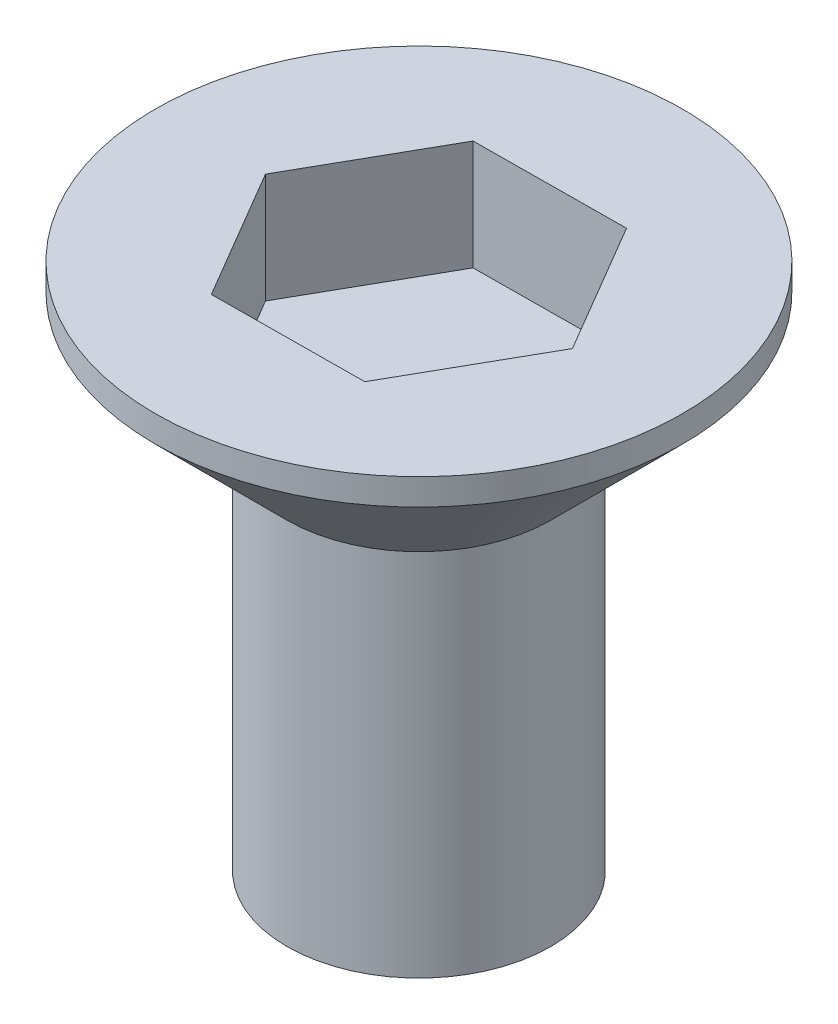
ISO-10303-21;
HEADER;
FILE_DESCRIPTION(('STEP AP214'),'2;1');
FILE_NAME('part.step','',(''),(''),'','','');
FILE_SCHEMA(('AUTOMOTIVE_DESIGN { 1 0 10303 214 1 1 1 1 }'));
ENDSEC;
DATA;
#1=APPLICATION_CONTEXT('core data for automotive mechanical design processes');
#2=APPLICATION_PROTOCOL_DEFINITION('international standard','automotive_design',2000,#1);
#3=PRODUCT_CONTEXT('',#1,'mechanical');
#4=PRODUCT('Part','Part','',(#3));
#5=PRODUCT_RELATED_PRODUCT_CATEGORY('part','',(#4));
#6=PRODUCT_DEFINITION_FORMATION('','',#4);
#7=PRODUCT_DEFINITION_CONTEXT('part definition',#1,'design');
#8=PRODUCT_DEFINITION('design','',#6,#7);
#9=PRODUCT_DEFINITION_SHAPE('','',#8);
#10=(LENGTH_UNIT() NAMED_UNIT(*) SI_UNIT(.MILLI.,.METRE.));
#11=(NAMED_UNIT(*) PLANE_ANGLE_UNIT() SI_UNIT($,.RADIAN.));
#12=(NAMED_UNIT(*) SI_UNIT($,.STERADIAN.) SOLID_ANGLE_UNIT());
#13=UNCERTAINTY_MEASURE_WITH_UNIT(LENGTH_MEASURE(1.E-05),#10,'distance_accuracy_value','');
#14=(GEOMETRIC_REPRESENTATION_CONTEXT(3) GLOBAL_UNCERTAINTY_ASSIGNED_CONTEXT((#13)) GLOBAL_UNIT_ASSIGNED_CONTEXT((#10,
#11,#12)) REPRESENTATION_CONTEXT('',''));
#15=CARTESIAN_POINT('',(0.,0.,0.));
#16=DIRECTION('',(0.,0.,1.));
#17=DIRECTION('',(1.,0.,0.));
#18=AXIS2_PLACEMENT_3D('',#15,#16,#17);
#19=CARTESIAN_POINT('',(0.,0.,0.));
#20=DIRECTION('',(0.,1.,0.));
#21=DIRECTION('',(0.,0.,1.));
#22=AXIS2_PLACEMENT_3D('',#19,#20,#21);
#23=PLANE('',#22);
#24=CARTESIAN_POINT('',(0.,0.,0.));
#25=DIRECTION('',(0.,1.,0.));
#26=DIRECTION('',(0.,0.,1.));
#27=AXIS2_PLACEMENT_3D('',#24,#25,#26);
#28=CIRCLE('',#27,3.);
#29=CARTESIAN_POINT('',(0.,0.,3.));
#30=VERTEX_POINT('',#29);
#31=EDGE_CURVE('E11',#30,#30,#28,.T.);
#32=ORIENTED_EDGE('',*,*,#31,.F.);
#33=EDGE_LOOP('',(#32));
#34=FACE_BOUND('',#33,.T.);
#35=ADVANCED_FACE('F35',(#34),#23,.F.);
#36=CARTESIAN_POINT('',(0.,68.6445759886598,0.));
#37=DIRECTION('',(0.,1.,0.));
#38=DIRECTION('',(0.,0.,1.));
#39=AXIS2_PLACEMENT_3D('',#36,#37,#38);
#40=CYLINDRICAL_SURFACE('',#39,3.);
#41=CARTESIAN_POINT('',(0.,8.39999999999999,0.));
#42=DIRECTION('',(0.,1.,0.));
#43=DIRECTION('',(0.,0.,1.));
#44=AXIS2_PLACEMENT_3D('',#41,#42,#43);
#45=CIRCLE('',#44,3.);
#46=CARTESIAN_POINT('',(0.,8.39999999999999,3.));
#47=VERTEX_POINT('',#46);
#48=EDGE_CURVE('E42',#47,#47,#45,.T.);
#49=ORIENTED_EDGE('',*,*,#48,.F.);
#50=EDGE_LOOP('',(#49));
#51=FACE_BOUND('',#50,.T.);
#52=ORIENTED_EDGE('',*,*,#31,.T.);
#53=EDGE_LOOP('',(#52));
#54=FACE_BOUND('',#53,.T.);
#55=ADVANCED_FACE('F151',(#51,#54),#40,.T.);
#56=CARTESIAN_POINT('',(0.,8.39999999999999,0.));
#57=DIRECTION('',(0.,1.,0.));
#58=DIRECTION('',(0.,0.,1.));
#59=AXIS2_PLACEMENT_3D('',#56,#57,#58);
#60=CONICAL_SURFACE('',#59,3.,0.785398163397447);
#61=CARTESIAN_POINT('',(0.,11.4,0.));
#62=DIRECTION('',(0.,1.,0.));
#63=DIRECTION('',(0.,0.,1.));
#64=AXIS2_PLACEMENT_3D('',#61,#62,#63);
#65=CIRCLE('',#64,6.);
#66=CARTESIAN_POINT('',(0.,11.4,6.));
#67=VERTEX_POINT('',#66);
#68=EDGE_CURVE('E144',#67,#67,#65,.T.);
#69=ORIENTED_EDGE('',*,*,#68,.F.);
#70=EDGE_LOOP('',(#69));
#71=FACE_BOUND('',#70,.T.);
#72=ORIENTED_EDGE('',*,*,#48,.T.);
#73=EDGE_LOOP('',(#72));
#74=FACE_BOUND('',#73,.T.);
#75=ADVANCED_FACE('F149',(#71,#74),#60,.T.);
#76=CARTESIAN_POINT('',(0.,68.6445759886598,0.));
#77=DIRECTION('',(0.,1.,0.));
#78=DIRECTION('',(0.,0.,1.));
#79=AXIS2_PLACEMENT_3D('',#76,#77,#78);
#80=CYLINDRICAL_SURFACE('',#79,6.);
#81=CARTESIAN_POINT('',(0.,12.,0.));
#82=DIRECTION('',(0.,1.,0.));
#83=DIRECTION('',(0.,0.,1.));
#84=AXIS2_PLACEMENT_3D('',#81,#82,#83);
#85=CIRCLE('',#84,6.);
#86=CARTESIAN_POINT('',(0.,12.,6.));
#87=VERTEX_POINT('',#86);
#88=EDGE_CURVE('E136',#87,#87,#85,.T.);
#89=ORIENTED_EDGE('',*,*,#88,.F.);
#90=EDGE_LOOP('',(#89));
#91=FACE_BOUND('',#90,.T.);
#92=ORIENTED_EDGE('',*,*,#68,.T.);
#93=EDGE_LOOP('',(#92));
#94=FACE_BOUND('',#93,.T.);
#95=ADVANCED_FACE('F169',(#91,#94),#80,.T.);
#96=CARTESIAN_POINT('',(6.,12.,0.));
#97=DIRECTION('',(0.,-1.,0.));
#98=DIRECTION('',(0.,0.,-1.));
#99=AXIS2_PLACEMENT_3D('',#96,#97,#98);
#100=PLANE('',#99);
#101=DIRECTION('',(0.493268448593922,0.,-0.869877139383341));
#102=VECTOR('',#101,1.);
#103=CARTESIAN_POINT('',(1.75526540341467,12.,2.98647674753639));
#104=LINE('',#103,#102);
#105=CARTESIAN_POINT('',(1.75526540341467,12.,2.98647674753639));
#106=VERTEX_POINT('',#105);
#107=CARTESIAN_POINT('',(3.46399743288537,12.,-0.0268660559728551));
#108=VERTEX_POINT('',#107);
#109=EDGE_CURVE('E123',#106,#108,#104,.T.);
#110=ORIENTED_EDGE('',*,*,#109,.F.);
#111=DIRECTION('',(0.999969925174272,0.,-0.00775556232399564));
#112=VECTOR('',#111,1.);
#113=CARTESIAN_POINT('',(-1.7087320294707,12.,3.01334280350924));
#114=LINE('',#113,#112);
#115=CARTESIAN_POINT('',(-1.7087320294707,12.,3.01334280350924));
#116=VERTEX_POINT('',#115);
#117=EDGE_CURVE('E49',#116,#106,#114,.T.);
#118=ORIENTED_EDGE('',*,*,#117,.F.);
#119=DIRECTION('',(0.506701476580349,0.,0.862121577059346));
#120=VECTOR('',#119,1.);
#121=CARTESIAN_POINT('',(-3.46399743288537,12.,0.0268660559728533));
#122=LINE('',#121,#120);
#123=CARTESIAN_POINT('',(-3.46399743288537,12.,0.0268660559728533));
#124=VERTEX_POINT('',#123);
#125=EDGE_CURVE('E132',#124,#116,#122,.T.);
#126=ORIENTED_EDGE('',*,*,#125,.F.);
#127=DIRECTION('',(-0.493268448593922,0.,0.869877139383341));
#128=VECTOR('',#127,1.);
#129=CARTESIAN_POINT('',(-1.75526540341467,12.,-2.98647674753639));
#130=LINE('',#129,#128);
#131=CARTESIAN_POINT('',(-1.75526540341467,12.,-2.98647674753639));
#132=VERTEX_POINT('',#131);
#133=EDGE_CURVE('E130',#132,#124,#130,.T.);
#134=ORIENTED_EDGE('',*,*,#133,.F.);
#135=DIRECTION('',(-0.999969925174272,0.,0.0077555623239955));
#136=VECTOR('',#135,1.);
#137=CARTESIAN_POINT('',(1.7087320294707,12.,-3.01334280350924));
#138=LINE('',#137,#136);
#139=CARTESIAN_POINT('',(1.7087320294707,12.,-3.01334280350924));
#140=VERTEX_POINT('',#139);
#141=EDGE_CURVE('E97',#140,#132,#138,.T.);
#142=ORIENTED_EDGE('',*,*,#141,.F.);
#143=DIRECTION('',(-0.506701476580349,0.,-0.862121577059346));
#144=VECTOR('',#143,1.);
#145=CARTESIAN_POINT('',(3.46399743288537,12.,-0.0268660559728551));
#146=LINE('',#145,#144);
#147=EDGE_CURVE('E126',#108,#140,#146,.T.);
#148=ORIENTED_EDGE('',*,*,#147,.F.);
#149=EDGE_LOOP('',(#110,#118,#126,#134,#142,#148));
#150=FACE_BOUND('',#149,.T.);
#151=ORIENTED_EDGE('',*,*,#88,.T.);
#152=EDGE_LOOP('',(#151));
#153=FACE_BOUND('',#152,.T.);
#154=ADVANCED_FACE('F177',(#150,#153),#100,.F.);
#155=CARTESIAN_POINT('',(-1.7087320294707,9.5,3.01334280350924));
#156=DIRECTION('',(0.00775556232399564,0.,0.999969925174272));
#157=DIRECTION('',(0.999969925174272,0.,-0.00775556232399564));
#158=AXIS2_PLACEMENT_3D('',#155,#156,#157);
#159=PLANE('',#158);
#160=ORIENTED_EDGE('',*,*,#117,.T.);
#161=DIRECTION('',(0.,1.,0.));
#162=VECTOR('',#161,1.);
#163=CARTESIAN_POINT('',(1.75526540341467,9.5,2.98647674753639));
#164=LINE('',#163,#162);
#165=CARTESIAN_POINT('',(1.75526540341467,9.5,2.98647674753639));
#166=VERTEX_POINT('',#165);
#167=EDGE_CURVE('E79',#166,#106,#164,.T.);
#168=ORIENTED_EDGE('',*,*,#167,.F.);
#169=DIRECTION('',(0.999969925174272,0.,-0.00775556232399564));
#170=VECTOR('',#169,1.);
#171=CARTESIAN_POINT('',(-1.7087320294707,9.5,3.01334280350924));
#172=LINE('',#171,#170);
#173=CARTESIAN_POINT('',(-1.7087320294707,9.5,3.01334280350924));
#174=VERTEX_POINT('',#173);
#175=EDGE_CURVE('E134',#174,#166,#172,.T.);
#176=ORIENTED_EDGE('',*,*,#175,.F.);
#177=DIRECTION('',(0.,1.,0.));
#178=VECTOR('',#177,1.);
#179=CARTESIAN_POINT('',(-1.7087320294707,9.5,3.01334280350924));
#180=LINE('',#179,#178);
#181=EDGE_CURVE('E57',#174,#116,#180,.T.);
#182=ORIENTED_EDGE('',*,*,#181,.T.);
#183=EDGE_LOOP('',(#160,#168,#176,#182));
#184=FACE_BOUND('',#183,.T.);
#185=ADVANCED_FACE('F185',(#184),#159,.F.);
#186=CARTESIAN_POINT('',(-3.46399743288537,9.5,0.0268660559728533));
#187=DIRECTION('',(-0.862121577059346,0.,0.506701476580349));
#188=DIRECTION('',(0.506701476580349,0.,0.862121577059346));
#189=AXIS2_PLACEMENT_3D('',#186,#187,#188);
#190=PLANE('',#189);
#191=ORIENTED_EDGE('',*,*,#125,.T.);
#192=ORIENTED_EDGE('',*,*,#181,.F.);
#193=DIRECTION('',(0.506701476580349,0.,0.862121577059346));
#194=VECTOR('',#193,1.);
#195=CARTESIAN_POINT('',(-3.46399743288537,9.5,0.0268660559728533));
#196=LINE('',#195,#194);
#197=CARTESIAN_POINT('',(-3.46399743288537,9.5,0.0268660559728533));
#198=VERTEX_POINT('',#197);
#199=EDGE_CURVE('E109',#198,#174,#196,.T.);
#200=ORIENTED_EDGE('',*,*,#199,.F.);
#201=DIRECTION('',(0.,1.,0.));
#202=VECTOR('',#201,1.);
#203=CARTESIAN_POINT('',(-3.46399743288537,9.5,0.0268660559728533));
#204=LINE('',#203,#202);
#205=EDGE_CURVE('E101',#198,#124,#204,.T.);
#206=ORIENTED_EDGE('',*,*,#205,.T.);
#207=EDGE_LOOP('',(#191,#192,#200,#206));
#208=FACE_BOUND('',#207,.T.);
#209=ADVANCED_FACE('F193',(#208),#190,.F.);
#210=CARTESIAN_POINT('',(-1.75526540341467,9.5,-2.98647674753639));
#211=DIRECTION('',(-0.869877139383341,0.,-0.493268448593922));
#212=DIRECTION('',(-0.493268448593922,0.,0.869877139383341));
#213=AXIS2_PLACEMENT_3D('',#210,#211,#212);
#214=PLANE('',#213);
#215=ORIENTED_EDGE('',*,*,#133,.T.);
#216=ORIENTED_EDGE('',*,*,#205,.F.);
#217=DIRECTION('',(-0.493268448593922,0.,0.869877139383341));
#218=VECTOR('',#217,1.);
#219=CARTESIAN_POINT('',(-1.75526540341467,9.5,-2.98647674753639));
#220=LINE('',#219,#218);
#221=CARTESIAN_POINT('',(-1.75526540341467,9.5,-2.98647674753639));
#222=VERTEX_POINT('',#221);
#223=EDGE_CURVE('E105',#222,#198,#220,.T.);
#224=ORIENTED_EDGE('',*,*,#223,.F.);
#225=DIRECTION('',(0.,1.,0.));
#226=VECTOR('',#225,1.);
#227=CARTESIAN_POINT('',(-1.75526540341467,9.5,-2.98647674753639));
#228=LINE('',#227,#226);
#229=EDGE_CURVE('E90',#222,#132,#228,.T.);
#230=ORIENTED_EDGE('',*,*,#229,.T.);
#231=EDGE_LOOP('',(#215,#216,#224,#230));
#232=FACE_BOUND('',#231,.T.);
#233=ADVANCED_FACE('F106',(#232),#214,.F.);
#234=CARTESIAN_POINT('',(1.7087320294707,9.5,-3.01334280350924));
#235=DIRECTION('',(-0.00775556232399551,0.,-0.999969925174272));
#236=DIRECTION('',(-0.999969925174272,0.,0.00775556232399551));
#237=AXIS2_PLACEMENT_3D('',#234,#235,#236);
#238=PLANE('',#237);
#239=ORIENTED_EDGE('',*,*,#141,.T.);
#240=ORIENTED_EDGE('',*,*,#229,.F.);
#241=DIRECTION('',(-0.999969925174272,0.,0.0077555623239955));
#242=VECTOR('',#241,1.);
#243=CARTESIAN_POINT('',(1.7087320294707,9.5,-3.01334280350924));
#244=LINE('',#243,#242);
#245=CARTESIAN_POINT('',(1.7087320294707,9.5,-3.01334280350924));
#246=VERTEX_POINT('',#245);
#247=EDGE_CURVE('E94',#246,#222,#244,.T.);
#248=ORIENTED_EDGE('',*,*,#247,.F.);
#249=DIRECTION('',(0.,1.,0.));
#250=VECTOR('',#249,1.);
#251=CARTESIAN_POINT('',(1.7087320294707,9.5,-3.01334280350924));
#252=LINE('',#251,#250);
#253=EDGE_CURVE('E102',#246,#140,#252,.T.);
#254=ORIENTED_EDGE('',*,*,#253,.T.);
#255=EDGE_LOOP('',(#239,#240,#248,#254));
#256=FACE_BOUND('',#255,.T.);
#257=ADVANCED_FACE('F92',(#256),#238,.F.);
#258=CARTESIAN_POINT('',(3.46399743288537,9.5,-0.0268660559728551));
#259=DIRECTION('',(0.862121577059346,0.,-0.506701476580349));
#260=DIRECTION('',(-0.506701476580349,0.,-0.862121577059346));
#261=AXIS2_PLACEMENT_3D('',#258,#259,#260);
#262=PLANE('',#261);
#263=ORIENTED_EDGE('',*,*,#147,.T.);
#264=ORIENTED_EDGE('',*,*,#253,.F.);
#265=DIRECTION('',(-0.506701476580349,0.,-0.862121577059346));
#266=VECTOR('',#265,1.);
#267=CARTESIAN_POINT('',(3.46399743288537,9.5,-0.0268660559728551));
#268=LINE('',#267,#266);
#269=CARTESIAN_POINT('',(3.46399743288537,9.5,-0.0268660559728551));
#270=VERTEX_POINT('',#269);
#271=EDGE_CURVE('E115',#270,#246,#268,.T.);
#272=ORIENTED_EDGE('',*,*,#271,.F.);
#273=DIRECTION('',(0.,1.,0.));
#274=VECTOR('',#273,1.);
#275=CARTESIAN_POINT('',(3.46399743288537,9.5,-0.0268660559728551));
#276=LINE('',#275,#274);
#277=EDGE_CURVE('E139',#270,#108,#276,.T.);
#278=ORIENTED_EDGE('',*,*,#277,.T.);
#279=EDGE_LOOP('',(#263,#264,#272,#278));
#280=FACE_BOUND('',#279,.T.);
#281=ADVANCED_FACE('F212',(#280),#262,.F.);
#282=CARTESIAN_POINT('',(1.75526540341467,9.5,2.98647674753639));
#283=DIRECTION('',(0.869877139383341,0.,0.493268448593922));
#284=DIRECTION('',(0.493268448593922,0.,-0.869877139383341));
#285=AXIS2_PLACEMENT_3D('',#282,#283,#284);
#286=PLANE('',#285);
#287=ORIENTED_EDGE('',*,*,#109,.T.);
#288=ORIENTED_EDGE('',*,*,#277,.F.);
#289=DIRECTION('',(0.493268448593922,0.,-0.869877139383341));
#290=VECTOR('',#289,1.);
#291=CARTESIAN_POINT('',(1.75526540341467,9.5,2.98647674753639));
#292=LINE('',#291,#290);
#293=EDGE_CURVE('E117',#166,#270,#292,.T.);
#294=ORIENTED_EDGE('',*,*,#293,.F.);
#295=ORIENTED_EDGE('',*,*,#167,.T.);
#296=EDGE_LOOP('',(#287,#288,#294,#295));
#297=FACE_BOUND('',#296,.T.);
#298=ADVANCED_FACE('F219',(#297),#286,.F.);
#299=CARTESIAN_POINT('',(0.,9.5,0.));
#300=DIRECTION('',(0.,1.,0.));
#301=DIRECTION('',(0.,0.,1.));
#302=AXIS2_PLACEMENT_3D('',#299,#300,#301);
#303=PLANE('',#302);
#304=ORIENTED_EDGE('',*,*,#175,.T.);
#305=ORIENTED_EDGE('',*,*,#293,.T.);
#306=ORIENTED_EDGE('',*,*,#271,.T.);
#307=ORIENTED_EDGE('',*,*,#247,.T.);
#308=ORIENTED_EDGE('',*,*,#223,.T.);
#309=ORIENTED_EDGE('',*,*,#199,.T.);
#310=EDGE_LOOP('',(#304,#305,#306,#307,#308,#309));
#311=FACE_BOUND('',#310,.T.);
#312=ADVANCED_FACE('F112',(#311),#303,.T.);
#313=CLOSED_SHELL('',(#35,#55,#75,#95,#154,#185,#209,#233,#257,#281,#298,#312));
#314=MANIFOLD_SOLID_BREP('B2',#313);
#315=ADVANCED_BREP_SHAPE_REPRESENTATION('',(#18,#314),#14);
#316=SHAPE_DEFINITION_REPRESENTATION(#9,#315);
ENDSEC;
END-ISO-10303-21;
